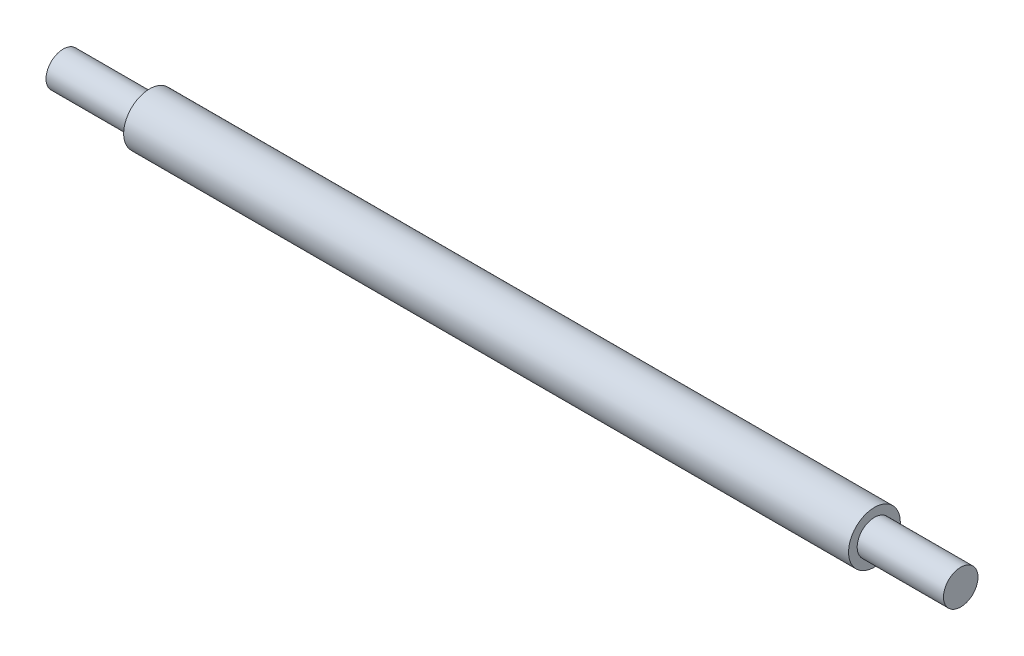
ISO-10303-21;
HEADER;
FILE_DESCRIPTION(('STEP AP214'),'2;1');
FILE_NAME('part.step','',(''),(''),'','','');
FILE_SCHEMA(('AUTOMOTIVE_DESIGN { 1 0 10303 214 1 1 1 1 }'));
ENDSEC;
DATA;
#1=APPLICATION_CONTEXT('core data for automotive mechanical design processes');
#2=APPLICATION_PROTOCOL_DEFINITION('international standard','automotive_design',2000,#1);
#3=PRODUCT_CONTEXT('',#1,'mechanical');
#4=PRODUCT('Part','Part','',(#3));
#5=PRODUCT_RELATED_PRODUCT_CATEGORY('part','',(#4));
#6=PRODUCT_DEFINITION_FORMATION('','',#4);
#7=PRODUCT_DEFINITION_CONTEXT('part definition',#1,'design');
#8=PRODUCT_DEFINITION('design','',#6,#7);
#9=PRODUCT_DEFINITION_SHAPE('','',#8);
#10=(LENGTH_UNIT() NAMED_UNIT(*) SI_UNIT(.MILLI.,.METRE.));
#11=(NAMED_UNIT(*) PLANE_ANGLE_UNIT() SI_UNIT($,.RADIAN.));
#12=(NAMED_UNIT(*) SI_UNIT($,.STERADIAN.) SOLID_ANGLE_UNIT());
#13=UNCERTAINTY_MEASURE_WITH_UNIT(LENGTH_MEASURE(1.E-05),#10,'distance_accuracy_value','');
#14=(GEOMETRIC_REPRESENTATION_CONTEXT(3) GLOBAL_UNCERTAINTY_ASSIGNED_CONTEXT((#13)) GLOBAL_UNIT_ASSIGNED_CONTEXT((#10,
#11,#12)) REPRESENTATION_CONTEXT('',''));
#15=CARTESIAN_POINT('',(0.,0.,0.));
#16=DIRECTION('',(0.,0.,1.));
#17=DIRECTION('',(1.,0.,0.));
#18=AXIS2_PLACEMENT_3D('',#15,#16,#17);
#19=CARTESIAN_POINT('',(84.,0.,0.));
#20=DIRECTION('',(-1.,0.,0.));
#21=DIRECTION('',(0.,0.,1.));
#22=AXIS2_PLACEMENT_3D('',#19,#20,#21);
#23=CYLINDRICAL_SURFACE('',#22,3.);
#24=CARTESIAN_POINT('',(84.,0.,0.));
#25=DIRECTION('',(1.,0.,0.));
#26=DIRECTION('',(0.,0.,-1.));
#27=AXIS2_PLACEMENT_3D('',#24,#25,#26);
#28=CIRCLE('',#27,3.);
#29=CARTESIAN_POINT('',(84.,0.,-3.));
#30=VERTEX_POINT('',#29);
#31=EDGE_CURVE('E51',#30,#30,#28,.T.);
#32=ORIENTED_EDGE('',*,*,#31,.F.);
#33=EDGE_LOOP('',(#32));
#34=FACE_BOUND('',#33,.T.);
#35=CARTESIAN_POINT('',(0.,0.,0.));
#36=DIRECTION('',(1.,0.,0.));
#37=DIRECTION('',(0.,0.,-1.));
#38=AXIS2_PLACEMENT_3D('',#35,#36,#37);
#39=CIRCLE('',#38,3.);
#40=CARTESIAN_POINT('',(0.,0.,-3.));
#41=VERTEX_POINT('',#40);
#42=EDGE_CURVE('E40',#41,#41,#39,.T.);
#43=ORIENTED_EDGE('',*,*,#42,.T.);
#44=EDGE_LOOP('',(#43));
#45=FACE_BOUND('',#44,.T.);
#46=ADVANCED_FACE('F37',(#34,#45),#23,.T.);
#47=CARTESIAN_POINT('',(84.,0.,0.));
#48=DIRECTION('',(1.,0.,0.));
#49=DIRECTION('',(0.,0.,-1.));
#50=AXIS2_PLACEMENT_3D('',#47,#48,#49);
#51=PLANE('',#50);
#52=CARTESIAN_POINT('',(84.,0.,0.));
#53=DIRECTION('',(1.,0.,0.));
#54=DIRECTION('',(0.,0.,-1.));
#55=AXIS2_PLACEMENT_3D('',#52,#53,#54);
#56=CIRCLE('',#55,2.);
#57=CARTESIAN_POINT('',(84.,0.,-2.));
#58=VERTEX_POINT('',#57);
#59=EDGE_CURVE('E45',#58,#58,#56,.T.);
#60=ORIENTED_EDGE('',*,*,#59,.F.);
#61=EDGE_LOOP('',(#60));
#62=FACE_BOUND('',#61,.T.);
#63=ORIENTED_EDGE('',*,*,#31,.T.);
#64=EDGE_LOOP('',(#63));
#65=FACE_BOUND('',#64,.T.);
#66=ADVANCED_FACE('F71',(#62,#65),#51,.T.);
#67=CARTESIAN_POINT('',(0.,0.,0.));
#68=DIRECTION('',(1.,0.,0.));
#69=DIRECTION('',(0.,0.,-1.));
#70=AXIS2_PLACEMENT_3D('',#67,#68,#69);
#71=PLANE('',#70);
#72=CARTESIAN_POINT('',(0.,0.,0.));
#73=DIRECTION('',(-1.,0.,0.));
#74=DIRECTION('',(0.,0.,1.));
#75=AXIS2_PLACEMENT_3D('',#72,#73,#74);
#76=CIRCLE('',#75,2.);
#77=CARTESIAN_POINT('',(0.,0.,2.));
#78=VERTEX_POINT('',#77);
#79=EDGE_CURVE('E10',#78,#78,#76,.T.);
#80=ORIENTED_EDGE('',*,*,#79,.F.);
#81=EDGE_LOOP('',(#80));
#82=FACE_BOUND('',#81,.T.);
#83=ORIENTED_EDGE('',*,*,#42,.F.);
#84=EDGE_LOOP('',(#83));
#85=FACE_BOUND('',#84,.T.);
#86=ADVANCED_FACE('F68',(#82,#85),#71,.F.);
#87=CARTESIAN_POINT('',(94.,0.,0.));
#88=DIRECTION('',(-1.,0.,0.));
#89=DIRECTION('',(0.,0.,1.));
#90=AXIS2_PLACEMENT_3D('',#87,#88,#89);
#91=CYLINDRICAL_SURFACE('',#90,2.);
#92=CARTESIAN_POINT('',(94.,0.,0.));
#93=DIRECTION('',(1.,0.,0.));
#94=DIRECTION('',(0.,0.,-1.));
#95=AXIS2_PLACEMENT_3D('',#92,#93,#94);
#96=CIRCLE('',#95,2.);
#97=CARTESIAN_POINT('',(94.,0.,-2.));
#98=VERTEX_POINT('',#97);
#99=EDGE_CURVE('E56',#98,#98,#96,.T.);
#100=ORIENTED_EDGE('',*,*,#99,.F.);
#101=EDGE_LOOP('',(#100));
#102=FACE_BOUND('',#101,.T.);
#103=ORIENTED_EDGE('',*,*,#59,.T.);
#104=EDGE_LOOP('',(#103));
#105=FACE_BOUND('',#104,.T.);
#106=ADVANCED_FACE('F70',(#102,#105),#91,.T.);
#107=CARTESIAN_POINT('',(94.,0.,0.));
#108=DIRECTION('',(1.,0.,0.));
#109=DIRECTION('',(0.,0.,-1.));
#110=AXIS2_PLACEMENT_3D('',#107,#108,#109);
#111=PLANE('',#110);
#112=ORIENTED_EDGE('',*,*,#99,.T.);
#113=EDGE_LOOP('',(#112));
#114=FACE_BOUND('',#113,.T.);
#115=ADVANCED_FACE('F77',(#114),#111,.T.);
#116=CARTESIAN_POINT('',(-10.,0.,0.));
#117=DIRECTION('',(1.,0.,0.));
#118=DIRECTION('',(0.,0.,-1.));
#119=AXIS2_PLACEMENT_3D('',#116,#117,#118);
#120=CYLINDRICAL_SURFACE('',#119,2.);
#121=CARTESIAN_POINT('',(-10.,0.,0.));
#122=DIRECTION('',(-1.,0.,0.));
#123=DIRECTION('',(0.,0.,1.));
#124=AXIS2_PLACEMENT_3D('',#121,#122,#123);
#125=CIRCLE('',#124,2.);
#126=CARTESIAN_POINT('',(-10.,0.,2.));
#127=VERTEX_POINT('',#126);
#128=EDGE_CURVE('E55',#127,#127,#125,.T.);
#129=ORIENTED_EDGE('',*,*,#128,.F.);
#130=EDGE_LOOP('',(#129));
#131=FACE_BOUND('',#130,.T.);
#132=ORIENTED_EDGE('',*,*,#79,.T.);
#133=EDGE_LOOP('',(#132));
#134=FACE_BOUND('',#133,.T.);
#135=ADVANCED_FACE('F105',(#131,#134),#120,.T.);
#136=CARTESIAN_POINT('',(-10.,0.,0.));
#137=DIRECTION('',(-1.,0.,0.));
#138=DIRECTION('',(0.,0.,1.));
#139=AXIS2_PLACEMENT_3D('',#136,#137,#138);
#140=PLANE('',#139);
#141=ORIENTED_EDGE('',*,*,#128,.T.);
#142=EDGE_LOOP('',(#141));
#143=FACE_BOUND('',#142,.T.);
#144=ADVANCED_FACE('F119',(#143),#140,.T.);
#145=CLOSED_SHELL('',(#46,#66,#86,#106,#115,#135,#144));
#146=MANIFOLD_SOLID_BREP('B2',#145);
#147=ADVANCED_BREP_SHAPE_REPRESENTATION('',(#18,#146),#14);
#148=SHAPE_DEFINITION_REPRESENTATION(#9,#147);
ENDSEC;
END-ISO-10303-21;
